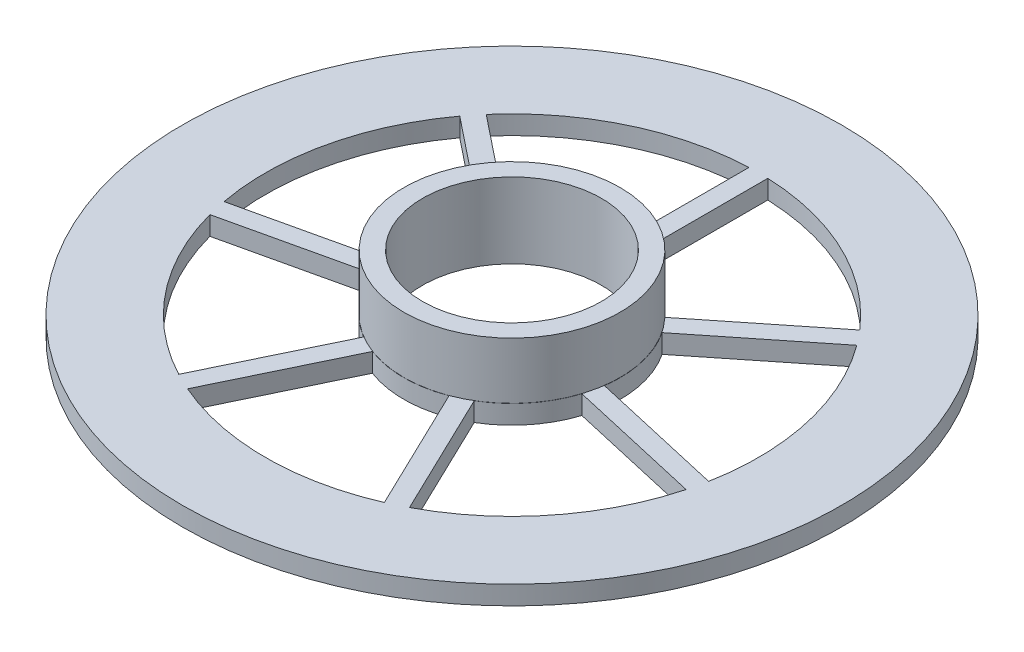
ISO-10303-21;
HEADER;
FILE_DESCRIPTION(('STEP AP214'),'2;1');
FILE_NAME('part.step','',(''),(''),'','','');
FILE_SCHEMA(('AUTOMOTIVE_DESIGN { 1 0 10303 214 1 1 1 1 }'));
ENDSEC;
DATA;
#1=APPLICATION_CONTEXT('core data for automotive mechanical design processes');
#2=APPLICATION_PROTOCOL_DEFINITION('international standard','automotive_design',2000,#1);
#3=PRODUCT_CONTEXT('',#1,'mechanical');
#4=PRODUCT('Part','Part','',(#3));
#5=PRODUCT_RELATED_PRODUCT_CATEGORY('part','',(#4));
#6=PRODUCT_DEFINITION_FORMATION('','',#4);
#7=PRODUCT_DEFINITION_CONTEXT('part definition',#1,'design');
#8=PRODUCT_DEFINITION('design','',#6,#7);
#9=PRODUCT_DEFINITION_SHAPE('','',#8);
#10=(LENGTH_UNIT() NAMED_UNIT(*) SI_UNIT(.MILLI.,.METRE.));
#11=(NAMED_UNIT(*) PLANE_ANGLE_UNIT() SI_UNIT($,.RADIAN.));
#12=(NAMED_UNIT(*) SI_UNIT($,.STERADIAN.) SOLID_ANGLE_UNIT());
#13=UNCERTAINTY_MEASURE_WITH_UNIT(LENGTH_MEASURE(1.E-05),#10,'distance_accuracy_value','');
#14=(GEOMETRIC_REPRESENTATION_CONTEXT(3) GLOBAL_UNCERTAINTY_ASSIGNED_CONTEXT((#13)) GLOBAL_UNIT_ASSIGNED_CONTEXT((#10,
#11,#12)) REPRESENTATION_CONTEXT('',''));
#15=CARTESIAN_POINT('',(0.,0.,0.));
#16=DIRECTION('',(0.,0.,1.));
#17=DIRECTION('',(1.,0.,0.));
#18=AXIS2_PLACEMENT_3D('',#15,#16,#17);
#19=CARTESIAN_POINT('',(0.,18.,0.));
#20=DIRECTION('',(0.,-1.,0.));
#21=DIRECTION('',(0.,0.,-1.));
#22=AXIS2_PLACEMENT_3D('',#19,#20,#21);
#23=CYLINDRICAL_SURFACE('',#22,9.5);
#24=CARTESIAN_POINT('',(0.,0.,0.));
#25=DIRECTION('',(0.,1.,0.));
#26=DIRECTION('',(0.,0.,1.));
#27=AXIS2_PLACEMENT_3D('',#24,#25,#26);
#28=CIRCLE('',#27,9.5);
#29=CARTESIAN_POINT('',(0.,0.,9.5));
#30=VERTEX_POINT('',#29);
#31=EDGE_CURVE('E371',#30,#30,#28,.T.);
#32=ORIENTED_EDGE('',*,*,#31,.F.);
#33=EDGE_LOOP('',(#32));
#34=FACE_BOUND('',#33,.T.);
#35=CARTESIAN_POINT('',(0.,8.,0.));
#36=DIRECTION('',(0.,1.,0.));
#37=DIRECTION('',(0.,0.,1.));
#38=AXIS2_PLACEMENT_3D('',#35,#36,#37);
#39=CIRCLE('',#38,9.5);
#40=CARTESIAN_POINT('',(0.,8.,9.5));
#41=VERTEX_POINT('',#40);
#42=EDGE_CURVE('E474',#41,#41,#39,.T.);
#43=ORIENTED_EDGE('',*,*,#42,.T.);
#44=EDGE_LOOP('',(#43));
#45=FACE_BOUND('',#44,.T.);
#46=ADVANCED_FACE('F35',(#34,#45),#23,.F.);
#47=CARTESIAN_POINT('',(0.,2.,0.));
#48=DIRECTION('',(0.,1.,0.));
#49=DIRECTION('',(0.,0.,1.));
#50=AXIS2_PLACEMENT_3D('',#47,#48,#49);
#51=CYLINDRICAL_SURFACE('',#50,11.4826099486734);
#52=CARTESIAN_POINT('',(0.,2.,0.));
#53=DIRECTION('',(0.,1.,0.));
#54=DIRECTION('',(0.,0.,1.));
#55=AXIS2_PLACEMENT_3D('',#52,#53,#54);
#56=CIRCLE('',#55,11.4826099486734);
#57=CARTESIAN_POINT('',(0.,2.,11.4826099486734));
#58=VERTEX_POINT('',#57);
#59=EDGE_CURVE('E237',#58,#58,#56,.T.);
#60=ORIENTED_EDGE('',*,*,#59,.T.);
#61=EDGE_LOOP('',(#60));
#62=FACE_BOUND('',#61,.T.);
#63=CARTESIAN_POINT('',(0.,8.,0.));
#64=DIRECTION('',(0.,1.,0.));
#65=DIRECTION('',(0.,0.,1.));
#66=AXIS2_PLACEMENT_3D('',#63,#64,#65);
#67=CIRCLE('',#66,11.4826099486734);
#68=CARTESIAN_POINT('',(0.,8.,11.4826099486734));
#69=VERTEX_POINT('',#68);
#70=EDGE_CURVE('E39',#69,#69,#67,.F.);
#71=ORIENTED_EDGE('',*,*,#70,.T.);
#72=EDGE_LOOP('',(#71));
#73=FACE_BOUND('',#72,.T.);
#74=ADVANCED_FACE('F481',(#62,#73),#51,.T.);
#75=CARTESIAN_POINT('',(0.,18.,0.));
#76=DIRECTION('',(0.,-1.,0.));
#77=DIRECTION('',(0.,0.,-1.));
#78=AXIS2_PLACEMENT_3D('',#75,#76,#77);
#79=CYLINDRICAL_SURFACE('',#78,35.);
#80=CARTESIAN_POINT('',(0.,0.,0.));
#81=DIRECTION('',(0.,1.,0.));
#82=DIRECTION('',(0.,0.,1.));
#83=AXIS2_PLACEMENT_3D('',#80,#81,#82);
#84=CIRCLE('',#83,35.);
#85=CARTESIAN_POINT('',(0.,0.,35.));
#86=VERTEX_POINT('',#85);
#87=EDGE_CURVE('E44',#86,#86,#84,.T.);
#88=ORIENTED_EDGE('',*,*,#87,.T.);
#89=EDGE_LOOP('',(#88));
#90=FACE_BOUND('',#89,.T.);
#91=CARTESIAN_POINT('',(0.,2.,0.));
#92=DIRECTION('',(0.,1.,0.));
#93=DIRECTION('',(0.,0.,1.));
#94=AXIS2_PLACEMENT_3D('',#91,#92,#93);
#95=CIRCLE('',#94,35.);
#96=CARTESIAN_POINT('',(0.,2.,35.));
#97=VERTEX_POINT('',#96);
#98=EDGE_CURVE('E396',#97,#97,#95,.T.);
#99=ORIENTED_EDGE('',*,*,#98,.F.);
#100=EDGE_LOOP('',(#99));
#101=FACE_BOUND('',#100,.T.);
#102=ADVANCED_FACE('F37',(#90,#101),#79,.T.);
#103=CARTESIAN_POINT('',(0.,18.,0.));
#104=DIRECTION('',(0.,-1.,0.));
#105=DIRECTION('',(0.,0.,-1.));
#106=AXIS2_PLACEMENT_3D('',#103,#104,#105);
#107=CYLINDRICAL_SURFACE('',#106,26.1837593960554);
#108=DIRECTION('',(0.,-1.,0.));
#109=VECTOR('',#108,1.);
#110=CARTESIAN_POINT('',(-1.,18.,-26.1646566212997));
#111=LINE('',#110,#109);
#112=CARTESIAN_POINT('',(-1.,2.,-26.1646566212997));
#113=VERTEX_POINT('',#112);
#114=CARTESIAN_POINT('',(-1.,0.,-26.1646566212997));
#115=VERTEX_POINT('',#114);
#116=EDGE_CURVE('E363',#113,#115,#111,.T.);
#117=ORIENTED_EDGE('',*,*,#116,.F.);
#118=CARTESIAN_POINT('',(0.,2.,0.));
#119=DIRECTION('',(0.,1.,0.));
#120=DIRECTION('',(0.,0.,1.));
#121=AXIS2_PLACEMENT_3D('',#118,#119,#120);
#122=CIRCLE('',#121,26.1837593960554);
#123=CARTESIAN_POINT('',(-19.8328624726392,2.,-17.0952280549837));
#124=VERTEX_POINT('',#123);
#125=EDGE_CURVE('E51',#113,#124,#122,.T.);
#126=ORIENTED_EDGE('',*,*,#125,.T.);
#127=DIRECTION('',(0.,-1.,0.));
#128=VECTOR('',#127,1.);
#129=CARTESIAN_POINT('',(-19.8328624726392,18.,-17.0952280549837));
#130=LINE('',#129,#128);
#131=CARTESIAN_POINT('',(-19.8328624726392,0.,-17.0952280549837));
#132=VERTEX_POINT('',#131);
#133=EDGE_CURVE('E369',#124,#132,#130,.T.);
#134=ORIENTED_EDGE('',*,*,#133,.T.);
#135=CARTESIAN_POINT('',(0.,0.,0.));
#136=DIRECTION('',(0.,1.,0.));
#137=DIRECTION('',(0.,0.,1.));
#138=AXIS2_PLACEMENT_3D('',#135,#136,#137);
#139=CIRCLE('',#138,26.1837593960554);
#140=EDGE_CURVE('E351',#115,#132,#139,.T.);
#141=ORIENTED_EDGE('',*,*,#140,.F.);
#142=EDGE_LOOP('',(#117,#126,#134,#141));
#143=FACE_BOUND('',#142,.T.);
#144=ADVANCED_FACE('F502',(#143),#107,.F.);
#145=CARTESIAN_POINT('',(-19.8328624726392,18.,-17.0952280549837));
#146=DIRECTION('',(0.623489801858733,0.,-0.78183148246803));
#147=DIRECTION('',(-0.78183148246803,0.,-0.623489801858734));
#148=AXIS2_PLACEMENT_3D('',#145,#146,#147);
#149=PLANE('',#148);
#150=ORIENTED_EDGE('',*,*,#133,.F.);
#151=DIRECTION('',(0.78183148246803,0.,0.623489801858734));
#152=VECTOR('',#151,1.);
#153=CARTESIAN_POINT('',(-19.8328624726392,2.,-17.0952280549837));
#154=LINE('',#153,#152);
#155=CARTESIAN_POINT('',(-8.33351507091476,2.,-7.9248045125944));
#156=VERTEX_POINT('',#155);
#157=EDGE_CURVE('E405',#124,#156,#154,.T.);
#158=ORIENTED_EDGE('',*,*,#157,.T.);
#159=DIRECTION('',(0.,-1.,0.));
#160=VECTOR('',#159,1.);
#161=CARTESIAN_POINT('',(-8.33351507091476,18.,-7.9248045125944));
#162=LINE('',#161,#160);
#163=CARTESIAN_POINT('',(-8.33351507091476,0.,-7.9248045125944));
#164=VERTEX_POINT('',#163);
#165=EDGE_CURVE('E367',#156,#164,#162,.T.);
#166=ORIENTED_EDGE('',*,*,#165,.T.);
#167=DIRECTION('',(0.78183148246803,0.,0.623489801858733));
#168=VECTOR('',#167,1.);
#169=CARTESIAN_POINT('',(-19.8328624726392,0.,-17.0952280549837));
#170=LINE('',#169,#168);
#171=EDGE_CURVE('E354',#132,#164,#170,.T.);
#172=ORIENTED_EDGE('',*,*,#171,.F.);
#173=EDGE_LOOP('',(#150,#158,#166,#172));
#174=FACE_BOUND('',#173,.T.);
#175=ADVANCED_FACE('F505',(#174),#149,.T.);
#176=CARTESIAN_POINT('',(0.,18.,0.));
#177=DIRECTION('',(0.,-1.,0.));
#178=DIRECTION('',(0.,0.,-1.));
#179=AXIS2_PLACEMENT_3D('',#176,#177,#178);
#180=CYLINDRICAL_SURFACE('',#179,11.5);
#181=ORIENTED_EDGE('',*,*,#165,.F.);
#182=CARTESIAN_POINT('',(0.,2.,0.));
#183=DIRECTION('',(0.,1.,0.));
#184=DIRECTION('',(0.,0.,1.));
#185=AXIS2_PLACEMENT_3D('',#182,#183,#184);
#186=CIRCLE('',#185,11.5);
#187=CARTESIAN_POINT('',(-0.999999999999998,2.,-11.4564392373896));
#188=VERTEX_POINT('',#187);
#189=EDGE_CURVE('E408',#156,#188,#186,.F.);
#190=ORIENTED_EDGE('',*,*,#189,.T.);
#191=DIRECTION('',(0.,-1.,0.));
#192=VECTOR('',#191,1.);
#193=CARTESIAN_POINT('',(-0.999999999999998,18.,-11.4564392373896));
#194=LINE('',#193,#192);
#195=CARTESIAN_POINT('',(-0.999999999999998,0.,-11.4564392373896));
#196=VERTEX_POINT('',#195);
#197=EDGE_CURVE('E365',#188,#196,#194,.T.);
#198=ORIENTED_EDGE('',*,*,#197,.T.);
#199=CARTESIAN_POINT('',(0.,0.,0.));
#200=DIRECTION('',(0.,-1.,0.));
#201=DIRECTION('',(0.,0.,1.));
#202=AXIS2_PLACEMENT_3D('',#199,#200,#201);
#203=CIRCLE('',#202,11.5);
#204=EDGE_CURVE('E357',#164,#196,#203,.T.);
#205=ORIENTED_EDGE('',*,*,#204,.F.);
#206=EDGE_LOOP('',(#181,#190,#198,#205));
#207=FACE_BOUND('',#206,.T.);
#208=ADVANCED_FACE('F509',(#207),#180,.T.);
#209=CARTESIAN_POINT('',(-1.,18.,-26.1646566212997));
#210=DIRECTION('',(-1.,0.,0.));
#211=DIRECTION('',(0.,0.,1.));
#212=AXIS2_PLACEMENT_3D('',#209,#210,#211);
#213=PLANE('',#212);
#214=ORIENTED_EDGE('',*,*,#197,.F.);
#215=DIRECTION('',(0.,0.,-1.));
#216=VECTOR('',#215,1.);
#217=CARTESIAN_POINT('',(-1.,2.,-26.1646566212997));
#218=LINE('',#217,#216);
#219=EDGE_CURVE('E411',#188,#113,#218,.T.);
#220=ORIENTED_EDGE('',*,*,#219,.T.);
#221=ORIENTED_EDGE('',*,*,#116,.T.);
#222=DIRECTION('',(0.,0.,-1.));
#223=VECTOR('',#222,1.);
#224=CARTESIAN_POINT('',(-1.,0.,-26.1646566212997));
#225=LINE('',#224,#223);
#226=EDGE_CURVE('E360',#196,#115,#225,.T.);
#227=ORIENTED_EDGE('',*,*,#226,.F.);
#228=EDGE_LOOP('',(#214,#220,#221,#227));
#229=FACE_BOUND('',#228,.T.);
#230=ADVANCED_FACE('F513',(#229),#213,.T.);
#231=CARTESIAN_POINT('',(0.,18.,0.));
#232=DIRECTION('',(0.,-1.,0.));
#233=DIRECTION('',(0.,0.,-1.));
#234=AXIS2_PLACEMENT_3D('',#231,#232,#233);
#235=CYLINDRICAL_SURFACE('',#234,26.1837593960554);
#236=DIRECTION('',(0.,-1.,0.));
#237=VECTOR('',#236,1.);
#238=CARTESIAN_POINT('',(25.7311749867147,18.,4.84725591583431));
#239=LINE('',#238,#237);
#240=CARTESIAN_POINT('',(25.7311749867147,2.,4.84725591583431));
#241=VERTEX_POINT('',#240);
#242=CARTESIAN_POINT('',(25.7311749867147,0.,4.84725591583431));
#243=VERTEX_POINT('',#242);
#244=EDGE_CURVE('E343',#241,#243,#239,.T.);
#245=ORIENTED_EDGE('',*,*,#244,.F.);
#246=CARTESIAN_POINT('',(0.,2.,0.));
#247=DIRECTION('',(0.,1.,0.));
#248=DIRECTION('',(0.,0.,1.));
#249=AXIS2_PLACEMENT_3D('',#246,#247,#248);
#250=CIRCLE('',#249,26.1837593960554);
#251=CARTESIAN_POINT('',(21.079842076356,2.,-15.5315650900484));
#252=VERTEX_POINT('',#251);
#253=EDGE_CURVE('E59',#241,#252,#250,.T.);
#254=ORIENTED_EDGE('',*,*,#253,.T.);
#255=DIRECTION('',(0.,-1.,0.));
#256=VECTOR('',#255,1.);
#257=CARTESIAN_POINT('',(21.079842076356,18.,-15.5315650900484));
#258=LINE('',#257,#256);
#259=CARTESIAN_POINT('',(21.079842076356,0.,-15.5315650900484));
#260=VERTEX_POINT('',#259);
#261=EDGE_CURVE('E349',#252,#260,#258,.T.);
#262=ORIENTED_EDGE('',*,*,#261,.T.);
#263=CARTESIAN_POINT('',(0.,0.,0.));
#264=DIRECTION('',(0.,1.,0.));
#265=DIRECTION('',(0.,0.,1.));
#266=AXIS2_PLACEMENT_3D('',#263,#264,#265);
#267=CIRCLE('',#266,26.1837593960554);
#268=EDGE_CURVE('E331',#243,#260,#267,.T.);
#269=ORIENTED_EDGE('',*,*,#268,.F.);
#270=EDGE_LOOP('',(#245,#254,#262,#269));
#271=FACE_BOUND('',#270,.T.);
#272=ADVANCED_FACE('F517',(#271),#235,.F.);
#273=CARTESIAN_POINT('',(21.079842076356,18.,-15.5315650900484));
#274=DIRECTION('',(0.623489801858734,0.,0.78183148246803));
#275=DIRECTION('',(0.78183148246803,0.,-0.623489801858734));
#276=AXIS2_PLACEMENT_3D('',#273,#274,#275);
#277=PLANE('',#276);
#278=ORIENTED_EDGE('',*,*,#261,.F.);
#279=DIRECTION('',(-0.78183148246803,0.,0.623489801858734));
#280=VECTOR('',#279,1.);
#281=CARTESIAN_POINT('',(21.079842076356,2.,-15.5315650900484));
#282=LINE('',#281,#280);
#283=CARTESIAN_POINT('',(9.58049467463161,2.,-6.36114154765913));
#284=VERTEX_POINT('',#283);
#285=EDGE_CURVE('E414',#252,#284,#282,.T.);
#286=ORIENTED_EDGE('',*,*,#285,.T.);
#287=DIRECTION('',(0.,-1.,0.));
#288=VECTOR('',#287,1.);
#289=CARTESIAN_POINT('',(9.58049467463162,18.,-6.36114154765914));
#290=LINE('',#289,#288);
#291=CARTESIAN_POINT('',(9.58049467463162,0.,-6.36114154765914));
#292=VERTEX_POINT('',#291);
#293=EDGE_CURVE('E347',#284,#292,#290,.T.);
#294=ORIENTED_EDGE('',*,*,#293,.T.);
#295=DIRECTION('',(-0.78183148246803,0.,0.623489801858734));
#296=VECTOR('',#295,1.);
#297=CARTESIAN_POINT('',(21.079842076356,0.,-15.5315650900484));
#298=LINE('',#297,#296);
#299=EDGE_CURVE('E334',#260,#292,#298,.T.);
#300=ORIENTED_EDGE('',*,*,#299,.F.);
#301=EDGE_LOOP('',(#278,#286,#294,#300));
#302=FACE_BOUND('',#301,.T.);
#303=ADVANCED_FACE('F521',(#302),#277,.T.);
#304=CARTESIAN_POINT('',(0.,18.,0.));
#305=DIRECTION('',(0.,-1.,0.));
#306=DIRECTION('',(0.,0.,-1.));
#307=AXIS2_PLACEMENT_3D('',#304,#305,#306);
#308=CYLINDRICAL_SURFACE('',#307,11.5);
#309=ORIENTED_EDGE('',*,*,#293,.F.);
#310=CARTESIAN_POINT('',(0.,2.,0.));
#311=DIRECTION('',(0.,1.,0.));
#312=DIRECTION('',(0.,0.,1.));
#313=AXIS2_PLACEMENT_3D('',#310,#311,#312);
#314=CIRCLE('',#313,11.5);
#315=CARTESIAN_POINT('',(11.3917233207027,2.,1.57436964673412));
#316=VERTEX_POINT('',#315);
#317=EDGE_CURVE('E417',#284,#316,#314,.F.);
#318=ORIENTED_EDGE('',*,*,#317,.T.);
#319=DIRECTION('',(0.,-1.,0.));
#320=VECTOR('',#319,1.);
#321=CARTESIAN_POINT('',(11.3917233207027,18.,1.57436964673412));
#322=LINE('',#321,#320);
#323=CARTESIAN_POINT('',(11.3917233207027,0.,1.57436964673412));
#324=VERTEX_POINT('',#323);
#325=EDGE_CURVE('E345',#316,#324,#322,.T.);
#326=ORIENTED_EDGE('',*,*,#325,.T.);
#327=CARTESIAN_POINT('',(0.,0.,0.));
#328=DIRECTION('',(0.,-1.,0.));
#329=DIRECTION('',(0.,0.,1.));
#330=AXIS2_PLACEMENT_3D('',#327,#328,#329);
#331=CIRCLE('',#330,11.5);
#332=EDGE_CURVE('E337',#292,#324,#331,.T.);
#333=ORIENTED_EDGE('',*,*,#332,.F.);
#334=EDGE_LOOP('',(#309,#318,#326,#333));
#335=FACE_BOUND('',#334,.T.);
#336=ADVANCED_FACE('F525',(#335),#308,.T.);
#337=CARTESIAN_POINT('',(25.7311749867147,18.,4.84725591583431));
#338=DIRECTION('',(0.222520933956314,0.,-0.974927912181824));
#339=DIRECTION('',(-0.974927912181824,0.,-0.222520933956314));
#340=AXIS2_PLACEMENT_3D('',#337,#338,#339);
#341=PLANE('',#340);
#342=ORIENTED_EDGE('',*,*,#325,.F.);
#343=DIRECTION('',(0.974927912181824,0.,0.222520933956314));
#344=VECTOR('',#343,1.);
#345=CARTESIAN_POINT('',(25.7311749867147,2.,4.84725591583431));
#346=LINE('',#345,#344);
#347=EDGE_CURVE('E420',#316,#241,#346,.T.);
#348=ORIENTED_EDGE('',*,*,#347,.T.);
#349=ORIENTED_EDGE('',*,*,#244,.T.);
#350=DIRECTION('',(0.974927912181824,0.,0.222520933956314));
#351=VECTOR('',#350,1.);
#352=CARTESIAN_POINT('',(25.7311749867147,0.,4.84725591583431));
#353=LINE('',#352,#351);
#354=EDGE_CURVE('E340',#324,#243,#353,.T.);
#355=ORIENTED_EDGE('',*,*,#354,.F.);
#356=EDGE_LOOP('',(#342,#348,#349,#355));
#357=FACE_BOUND('',#356,.T.);
#358=ADVANCED_FACE('F529',(#357),#341,.T.);
#359=CARTESIAN_POINT('',(0.,18.,0.));
#360=DIRECTION('',(0.,-1.,0.));
#361=DIRECTION('',(0.,0.,-1.));
#362=AXIS2_PLACEMENT_3D('',#359,#360,#361);
#363=CYLINDRICAL_SURFACE('',#362,11.5);
#364=DIRECTION('',(0.,-1.,0.));
#365=VECTOR('',#364,1.);
#366=CARTESIAN_POINT('',(0.999999999999998,18.,-11.4564392373896));
#367=LINE('',#366,#365);
#368=CARTESIAN_POINT('',(0.999999999999998,2.,-11.4564392373896));
#369=VERTEX_POINT('',#368);
#370=CARTESIAN_POINT('',(0.999999999999998,0.,-11.4564392373896));
#371=VERTEX_POINT('',#370);
#372=EDGE_CURVE('E323',#369,#371,#367,.T.);
#373=ORIENTED_EDGE('',*,*,#372,.F.);
#374=CARTESIAN_POINT('',(0.,2.,0.));
#375=DIRECTION('',(0.,1.,0.));
#376=DIRECTION('',(0.,0.,1.));
#377=AXIS2_PLACEMENT_3D('',#374,#375,#376);
#378=CIRCLE('',#377,11.5);
#379=CARTESIAN_POINT('',(8.33351507091407,2.,-7.92480451259513));
#380=VERTEX_POINT('',#379);
#381=EDGE_CURVE('E422',#369,#380,#378,.F.);
#382=ORIENTED_EDGE('',*,*,#381,.T.);
#383=DIRECTION('',(0.,-1.,0.));
#384=VECTOR('',#383,1.);
#385=CARTESIAN_POINT('',(8.33351507091407,18.,-7.92480451259513));
#386=LINE('',#385,#384);
#387=CARTESIAN_POINT('',(8.33351507091407,0.,-7.92480451259513));
#388=VERTEX_POINT('',#387);
#389=EDGE_CURVE('E329',#380,#388,#386,.T.);
#390=ORIENTED_EDGE('',*,*,#389,.T.);
#391=CARTESIAN_POINT('',(0.,0.,0.));
#392=DIRECTION('',(0.,-1.,0.));
#393=DIRECTION('',(0.,0.,1.));
#394=AXIS2_PLACEMENT_3D('',#391,#392,#393);
#395=CIRCLE('',#394,11.5);
#396=EDGE_CURVE('E311',#371,#388,#395,.T.);
#397=ORIENTED_EDGE('',*,*,#396,.F.);
#398=EDGE_LOOP('',(#373,#382,#390,#397));
#399=FACE_BOUND('',#398,.T.);
#400=ADVANCED_FACE('F533',(#399),#363,.T.);
#401=CARTESIAN_POINT('',(19.8328624726385,18.,-17.0952280549844));
#402=DIRECTION('',(-0.623489801858734,0.,-0.78183148246803));
#403=DIRECTION('',(-0.78183148246803,0.,0.623489801858734));
#404=AXIS2_PLACEMENT_3D('',#401,#402,#403);
#405=PLANE('',#404);
#406=ORIENTED_EDGE('',*,*,#389,.F.);
#407=DIRECTION('',(0.78183148246803,0.,-0.623489801858734));
#408=VECTOR('',#407,1.);
#409=CARTESIAN_POINT('',(19.8328624726385,2.,-17.0952280549844));
#410=LINE('',#409,#408);
#411=CARTESIAN_POINT('',(19.8328624726385,2.,-17.0952280549844));
#412=VERTEX_POINT('',#411);
#413=EDGE_CURVE('E425',#380,#412,#410,.T.);
#414=ORIENTED_EDGE('',*,*,#413,.T.);
#415=DIRECTION('',(0.,-1.,0.));
#416=VECTOR('',#415,1.);
#417=CARTESIAN_POINT('',(19.8328624726385,18.,-17.0952280549844));
#418=LINE('',#417,#416);
#419=CARTESIAN_POINT('',(19.8328624726385,0.,-17.0952280549844));
#420=VERTEX_POINT('',#419);
#421=EDGE_CURVE('E327',#412,#420,#418,.T.);
#422=ORIENTED_EDGE('',*,*,#421,.T.);
#423=DIRECTION('',(0.78183148246803,0.,-0.623489801858734));
#424=VECTOR('',#423,1.);
#425=CARTESIAN_POINT('',(19.8328624726385,0.,-17.0952280549844));
#426=LINE('',#425,#424);
#427=EDGE_CURVE('E314',#388,#420,#426,.T.);
#428=ORIENTED_EDGE('',*,*,#427,.F.);
#429=EDGE_LOOP('',(#406,#414,#422,#428));
#430=FACE_BOUND('',#429,.T.);
#431=ADVANCED_FACE('F537',(#430),#405,.T.);
#432=CARTESIAN_POINT('',(0.,18.,0.));
#433=DIRECTION('',(0.,-1.,0.));
#434=DIRECTION('',(0.,0.,-1.));
#435=AXIS2_PLACEMENT_3D('',#432,#433,#434);
#436=CYLINDRICAL_SURFACE('',#435,26.1837593960554);
#437=ORIENTED_EDGE('',*,*,#421,.F.);
#438=CARTESIAN_POINT('',(0.,2.,0.));
#439=DIRECTION('',(0.,1.,0.));
#440=DIRECTION('',(0.,0.,1.));
#441=AXIS2_PLACEMENT_3D('',#438,#439,#440);
#442=CIRCLE('',#441,26.1837593960554);
#443=CARTESIAN_POINT('',(1.,2.,-26.1646566212997));
#444=VERTEX_POINT('',#443);
#445=EDGE_CURVE('E428',#412,#444,#442,.T.);
#446=ORIENTED_EDGE('',*,*,#445,.T.);
#447=DIRECTION('',(0.,-1.,0.));
#448=VECTOR('',#447,1.);
#449=CARTESIAN_POINT('',(1.00000000000001,18.,-26.1646566212997));
#450=LINE('',#449,#448);
#451=CARTESIAN_POINT('',(1.00000000000001,0.,-26.1646566212997));
#452=VERTEX_POINT('',#451);
#453=EDGE_CURVE('E325',#444,#452,#450,.T.);
#454=ORIENTED_EDGE('',*,*,#453,.T.);
#455=CARTESIAN_POINT('',(0.,0.,0.));
#456=DIRECTION('',(0.,1.,0.));
#457=DIRECTION('',(0.,0.,1.));
#458=AXIS2_PLACEMENT_3D('',#455,#456,#457);
#459=CIRCLE('',#458,26.1837593960554);
#460=EDGE_CURVE('E317',#420,#452,#459,.T.);
#461=ORIENTED_EDGE('',*,*,#460,.F.);
#462=EDGE_LOOP('',(#437,#446,#454,#461));
#463=FACE_BOUND('',#462,.T.);
#464=ADVANCED_FACE('F541',(#463),#436,.F.);
#465=CARTESIAN_POINT('',(1.,18.,-26.1646566212997));
#466=DIRECTION('',(1.,0.,0.));
#467=DIRECTION('',(0.,0.,-1.));
#468=AXIS2_PLACEMENT_3D('',#465,#466,#467);
#469=PLANE('',#468);
#470=ORIENTED_EDGE('',*,*,#453,.F.);
#471=DIRECTION('',(0.,0.,1.));
#472=VECTOR('',#471,1.);
#473=CARTESIAN_POINT('',(1.,2.,-26.1646566212997));
#474=LINE('',#473,#472);
#475=EDGE_CURVE('E431',#444,#369,#474,.T.);
#476=ORIENTED_EDGE('',*,*,#475,.T.);
#477=ORIENTED_EDGE('',*,*,#372,.T.);
#478=DIRECTION('',(0.,0.,1.));
#479=VECTOR('',#478,1.);
#480=CARTESIAN_POINT('',(1.,0.,-26.1646566212997));
#481=LINE('',#480,#479);
#482=EDGE_CURVE('E320',#452,#371,#481,.T.);
#483=ORIENTED_EDGE('',*,*,#482,.F.);
#484=EDGE_LOOP('',(#470,#476,#477,#483));
#485=FACE_BOUND('',#484,.T.);
#486=ADVANCED_FACE('F545',(#485),#469,.T.);
#487=CARTESIAN_POINT('',(0.,18.,0.));
#488=DIRECTION('',(0.,-1.,0.));
#489=DIRECTION('',(0.,0.,-1.));
#490=AXIS2_PLACEMENT_3D('',#487,#488,#489);
#491=CYLINDRICAL_SURFACE('',#490,26.1837593960554);
#492=DIRECTION('',(0.,-1.,0.));
#493=VECTOR('',#492,1.);
#494=CARTESIAN_POINT('',(-21.0798420763567,18.,-15.5315650900476));
#495=LINE('',#494,#493);
#496=CARTESIAN_POINT('',(-21.0798420763567,2.,-15.5315650900476));
#497=VERTEX_POINT('',#496);
#498=CARTESIAN_POINT('',(-21.0798420763567,0.,-15.5315650900476));
#499=VERTEX_POINT('',#498);
#500=EDGE_CURVE('E303',#497,#499,#495,.T.);
#501=ORIENTED_EDGE('',*,*,#500,.F.);
#502=CARTESIAN_POINT('',(0.,2.,0.));
#503=DIRECTION('',(0.,1.,0.));
#504=DIRECTION('',(0.,0.,1.));
#505=AXIS2_PLACEMENT_3D('',#502,#503,#504);
#506=CIRCLE('',#505,26.1837593960554);
#507=CARTESIAN_POINT('',(-25.731174986714,2.,4.84725591583754));
#508=VERTEX_POINT('',#507);
#509=EDGE_CURVE('E434',#497,#508,#506,.T.);
#510=ORIENTED_EDGE('',*,*,#509,.T.);
#511=DIRECTION('',(0.,-1.,0.));
#512=VECTOR('',#511,1.);
#513=CARTESIAN_POINT('',(-25.731174986714,18.,4.84725591583754));
#514=LINE('',#513,#512);
#515=CARTESIAN_POINT('',(-25.731174986714,0.,4.84725591583754));
#516=VERTEX_POINT('',#515);
#517=EDGE_CURVE('E309',#508,#516,#514,.T.);
#518=ORIENTED_EDGE('',*,*,#517,.T.);
#519=CARTESIAN_POINT('',(0.,0.,0.));
#520=DIRECTION('',(0.,1.,0.));
#521=DIRECTION('',(0.,0.,1.));
#522=AXIS2_PLACEMENT_3D('',#519,#520,#521);
#523=CIRCLE('',#522,26.1837593960554);
#524=EDGE_CURVE('E291',#499,#516,#523,.T.);
#525=ORIENTED_EDGE('',*,*,#524,.F.);
#526=EDGE_LOOP('',(#501,#510,#518,#525));
#527=FACE_BOUND('',#526,.T.);
#528=ADVANCED_FACE('F549',(#527),#491,.F.);
#529=CARTESIAN_POINT('',(-25.731174986714,18.,4.84725591583754));
#530=DIRECTION('',(-0.222520933956315,0.,-0.974927912181823));
#531=DIRECTION('',(-0.974927912181824,0.,0.222520933956315));
#532=AXIS2_PLACEMENT_3D('',#529,#530,#531);
#533=PLANE('',#532);
#534=ORIENTED_EDGE('',*,*,#517,.F.);
#535=DIRECTION('',(0.974927912181824,0.,-0.222520933956315));
#536=VECTOR('',#535,1.);
#537=CARTESIAN_POINT('',(-25.731174986714,2.,4.84725591583754));
#538=LINE('',#537,#536);
#539=CARTESIAN_POINT('',(-11.3917233207023,2.,1.57436964673739));
#540=VERTEX_POINT('',#539);
#541=EDGE_CURVE('E437',#508,#540,#538,.T.);
#542=ORIENTED_EDGE('',*,*,#541,.T.);
#543=DIRECTION('',(0.,-1.,0.));
#544=VECTOR('',#543,1.);
#545=CARTESIAN_POINT('',(-11.3917233207023,18.,1.57436964673739));
#546=LINE('',#545,#544);
#547=CARTESIAN_POINT('',(-11.3917233207023,0.,1.57436964673739));
#548=VERTEX_POINT('',#547);
#549=EDGE_CURVE('E307',#540,#548,#546,.T.);
#550=ORIENTED_EDGE('',*,*,#549,.T.);
#551=DIRECTION('',(0.974927912181824,0.,-0.222520933956315));
#552=VECTOR('',#551,1.);
#553=CARTESIAN_POINT('',(-25.731174986714,0.,4.84725591583754));
#554=LINE('',#553,#552);
#555=EDGE_CURVE('E294',#516,#548,#554,.T.);
#556=ORIENTED_EDGE('',*,*,#555,.F.);
#557=EDGE_LOOP('',(#534,#542,#550,#556));
#558=FACE_BOUND('',#557,.T.);
#559=ADVANCED_FACE('F553',(#558),#533,.T.);
#560=CARTESIAN_POINT('',(0.,18.,0.));
#561=DIRECTION('',(0.,-1.,0.));
#562=DIRECTION('',(0.,0.,-1.));
#563=AXIS2_PLACEMENT_3D('',#560,#561,#562);
#564=CYLINDRICAL_SURFACE('',#563,11.5);
#565=ORIENTED_EDGE('',*,*,#549,.F.);
#566=CARTESIAN_POINT('',(0.,2.,0.));
#567=DIRECTION('',(0.,1.,0.));
#568=DIRECTION('',(0.,0.,1.));
#569=AXIS2_PLACEMENT_3D('',#566,#567,#568);
#570=CIRCLE('',#569,11.5);
#571=CARTESIAN_POINT('',(-9.58049467463218,2.,-6.36114154765829));
#572=VERTEX_POINT('',#571);
#573=EDGE_CURVE('E440',#540,#572,#570,.F.);
#574=ORIENTED_EDGE('',*,*,#573,.T.);
#575=DIRECTION('',(0.,-1.,0.));
#576=VECTOR('',#575,1.);
#577=CARTESIAN_POINT('',(-9.58049467463218,18.,-6.36114154765829));
#578=LINE('',#577,#576);
#579=CARTESIAN_POINT('',(-9.58049467463218,0.,-6.36114154765829));
#580=VERTEX_POINT('',#579);
#581=EDGE_CURVE('E305',#572,#580,#578,.T.);
#582=ORIENTED_EDGE('',*,*,#581,.T.);
#583=CARTESIAN_POINT('',(0.,0.,0.));
#584=DIRECTION('',(0.,-1.,0.));
#585=DIRECTION('',(0.,0.,1.));
#586=AXIS2_PLACEMENT_3D('',#583,#584,#585);
#587=CIRCLE('',#586,11.5);
#588=EDGE_CURVE('E297',#548,#580,#587,.T.);
#589=ORIENTED_EDGE('',*,*,#588,.F.);
#590=EDGE_LOOP('',(#565,#574,#582,#589));
#591=FACE_BOUND('',#590,.T.);
#592=ADVANCED_FACE('F557',(#591),#564,.T.);
#593=CARTESIAN_POINT('',(-21.0798420763567,18.,-15.5315650900476));
#594=DIRECTION('',(-0.623489801858733,0.,0.78183148246803));
#595=DIRECTION('',(0.78183148246803,0.,0.623489801858733));
#596=AXIS2_PLACEMENT_3D('',#593,#594,#595);
#597=PLANE('',#596);
#598=ORIENTED_EDGE('',*,*,#581,.F.);
#599=DIRECTION('',(-0.78183148246803,0.,-0.623489801858733));
#600=VECTOR('',#599,1.);
#601=CARTESIAN_POINT('',(-21.0798420763567,2.,-15.5315650900476));
#602=LINE('',#601,#600);
#603=EDGE_CURVE('E443',#572,#497,#602,.T.);
#604=ORIENTED_EDGE('',*,*,#603,.T.);
#605=ORIENTED_EDGE('',*,*,#500,.T.);
#606=DIRECTION('',(-0.78183148246803,0.,-0.623489801858733));
#607=VECTOR('',#606,1.);
#608=CARTESIAN_POINT('',(-21.0798420763567,0.,-15.5315650900476));
#609=LINE('',#608,#607);
#610=EDGE_CURVE('E300',#580,#499,#609,.T.);
#611=ORIENTED_EDGE('',*,*,#610,.F.);
#612=EDGE_LOOP('',(#598,#604,#605,#611));
#613=FACE_BOUND('',#612,.T.);
#614=ADVANCED_FACE('F561',(#613),#597,.T.);
#615=CARTESIAN_POINT('',(0.,18.,0.));
#616=DIRECTION('',(0.,-1.,0.));
#617=DIRECTION('',(0.,0.,-1.));
#618=AXIS2_PLACEMENT_3D('',#615,#616,#617);
#619=CYLINDRICAL_SURFACE('',#618,26.1837593960554);
#620=DIRECTION('',(0.,-1.,0.));
#621=VECTOR('',#620,1.);
#622=CARTESIAN_POINT('',(12.2533879154812,18.,23.1396573160291));
#623=LINE('',#622,#621);
#624=CARTESIAN_POINT('',(12.2533879154812,2.,23.1396573160291));
#625=VERTEX_POINT('',#624);
#626=CARTESIAN_POINT('',(12.2533879154812,0.,23.1396573160291));
#627=VERTEX_POINT('',#626);
#628=EDGE_CURVE('E283',#625,#627,#623,.T.);
#629=ORIENTED_EDGE('',*,*,#628,.F.);
#630=CARTESIAN_POINT('',(0.,2.,0.));
#631=DIRECTION('',(0.,1.,0.));
#632=DIRECTION('',(0.,0.,1.));
#633=AXIS2_PLACEMENT_3D('',#630,#631,#632);
#634=CIRCLE('',#633,26.1837593960554);
#635=CARTESIAN_POINT('',(25.2861331188022,2.,6.79711174019798));
#636=VERTEX_POINT('',#635);
#637=EDGE_CURVE('E446',#625,#636,#634,.T.);
#638=ORIENTED_EDGE('',*,*,#637,.T.);
#639=DIRECTION('',(0.,-1.,0.));
#640=VECTOR('',#639,1.);
#641=CARTESIAN_POINT('',(25.2861331188022,18.,6.79711174019798));
#642=LINE('',#641,#640);
#643=CARTESIAN_POINT('',(25.2861331188022,0.,6.79711174019798));
#644=VERTEX_POINT('',#643);
#645=EDGE_CURVE('E289',#636,#644,#642,.T.);
#646=ORIENTED_EDGE('',*,*,#645,.T.);
#647=CARTESIAN_POINT('',(0.,0.,0.));
#648=DIRECTION('',(0.,1.,0.));
#649=DIRECTION('',(0.,0.,1.));
#650=AXIS2_PLACEMENT_3D('',#647,#648,#649);
#651=CIRCLE('',#650,26.1837593960554);
#652=EDGE_CURVE('E271',#627,#644,#651,.T.);
#653=ORIENTED_EDGE('',*,*,#652,.F.);
#654=EDGE_LOOP('',(#629,#638,#646,#653));
#655=FACE_BOUND('',#654,.T.);
#656=ADVANCED_FACE('F565',(#655),#619,.F.);
#657=CARTESIAN_POINT('',(25.2861331188022,18.,6.79711174019798));
#658=DIRECTION('',(-0.222520933956314,0.,0.974927912181824));
#659=DIRECTION('',(0.974927912181824,0.,0.222520933956314));
#660=AXIS2_PLACEMENT_3D('',#657,#658,#659);
#661=PLANE('',#660);
#662=ORIENTED_EDGE('',*,*,#645,.F.);
#663=DIRECTION('',(-0.974927912181824,0.,-0.222520933956314));
#664=VECTOR('',#663,1.);
#665=CARTESIAN_POINT('',(25.2861331188022,2.,6.79711174019798));
#666=LINE('',#665,#664);
#667=CARTESIAN_POINT('',(10.9466814527904,2.,3.52422547109784));
#668=VERTEX_POINT('',#667);
#669=EDGE_CURVE('E449',#636,#668,#666,.T.);
#670=ORIENTED_EDGE('',*,*,#669,.T.);
#671=DIRECTION('',(0.,-1.,0.));
#672=VECTOR('',#671,1.);
#673=CARTESIAN_POINT('',(10.9466814527904,18.,3.52422547109784));
#674=LINE('',#673,#672);
#675=CARTESIAN_POINT('',(10.9466814527904,0.,3.52422547109784));
#676=VERTEX_POINT('',#675);
#677=EDGE_CURVE('E287',#668,#676,#674,.T.);
#678=ORIENTED_EDGE('',*,*,#677,.T.);
#679=DIRECTION('',(-0.974927912181824,0.,-0.222520933956314));
#680=VECTOR('',#679,1.);
#681=CARTESIAN_POINT('',(25.2861331188022,0.,6.79711174019798));
#682=LINE('',#681,#680);
#683=EDGE_CURVE('E274',#644,#676,#682,.T.);
#684=ORIENTED_EDGE('',*,*,#683,.F.);
#685=EDGE_LOOP('',(#662,#670,#678,#684));
#686=FACE_BOUND('',#685,.T.);
#687=ADVANCED_FACE('F569',(#686),#661,.T.);
#688=CARTESIAN_POINT('',(0.,18.,0.));
#689=DIRECTION('',(0.,-1.,0.));
#690=DIRECTION('',(0.,0.,-1.));
#691=AXIS2_PLACEMENT_3D('',#688,#689,#690);
#692=CYLINDRICAL_SURFACE('',#691,11.5);
#693=ORIENTED_EDGE('',*,*,#677,.F.);
#694=CARTESIAN_POINT('',(0.,2.,0.));
#695=DIRECTION('',(0.,1.,0.));
#696=DIRECTION('',(0.,0.,1.));
#697=AXIS2_PLACEMENT_3D('',#694,#695,#696);
#698=CIRCLE('',#697,11.5);
#699=CARTESIAN_POINT('',(5.87173156119637,2.,9.88801135078487));
#700=VERTEX_POINT('',#699);
#701=EDGE_CURVE('E452',#668,#700,#698,.F.);
#702=ORIENTED_EDGE('',*,*,#701,.T.);
#703=DIRECTION('',(0.,-1.,0.));
#704=VECTOR('',#703,1.);
#705=CARTESIAN_POINT('',(5.87173156119638,18.,9.88801135078487));
#706=LINE('',#705,#704);
#707=CARTESIAN_POINT('',(5.87173156119638,0.,9.88801135078487));
#708=VERTEX_POINT('',#707);
#709=EDGE_CURVE('E285',#700,#708,#706,.T.);
#710=ORIENTED_EDGE('',*,*,#709,.T.);
#711=CARTESIAN_POINT('',(0.,0.,0.));
#712=DIRECTION('',(0.,-1.,0.));
#713=DIRECTION('',(0.,0.,1.));
#714=AXIS2_PLACEMENT_3D('',#711,#712,#713);
#715=CIRCLE('',#714,11.5);
#716=EDGE_CURVE('E277',#676,#708,#715,.T.);
#717=ORIENTED_EDGE('',*,*,#716,.F.);
#718=EDGE_LOOP('',(#693,#702,#710,#717));
#719=FACE_BOUND('',#718,.T.);
#720=ADVANCED_FACE('F573',(#719),#692,.T.);
#721=CARTESIAN_POINT('',(12.2533879154812,18.,23.1396573160291));
#722=DIRECTION('',(0.900968867902419,0.,-0.433883739117558));
#723=DIRECTION('',(-0.433883739117559,0.,-0.900968867902419));
#724=AXIS2_PLACEMENT_3D('',#721,#722,#723);
#725=PLANE('',#724);
#726=ORIENTED_EDGE('',*,*,#709,.F.);
#727=DIRECTION('',(0.433883739117559,0.,0.900968867902419));
#728=VECTOR('',#727,1.);
#729=CARTESIAN_POINT('',(12.2533879154812,2.,23.1396573160291));
#730=LINE('',#729,#728);
#731=EDGE_CURVE('E455',#700,#625,#730,.T.);
#732=ORIENTED_EDGE('',*,*,#731,.T.);
#733=ORIENTED_EDGE('',*,*,#628,.T.);
#734=DIRECTION('',(0.433883739117559,0.,0.900968867902419));
#735=VECTOR('',#734,1.);
#736=CARTESIAN_POINT('',(12.2533879154812,0.,23.1396573160291));
#737=LINE('',#736,#735);
#738=EDGE_CURVE('E280',#708,#627,#737,.T.);
#739=ORIENTED_EDGE('',*,*,#738,.F.);
#740=EDGE_LOOP('',(#726,#732,#733,#739));
#741=FACE_BOUND('',#740,.T.);
#742=ADVANCED_FACE('F577',(#741),#725,.T.);
#743=CARTESIAN_POINT('',(0.,18.,0.));
#744=DIRECTION('',(0.,-1.,0.));
#745=DIRECTION('',(0.,0.,-1.));
#746=AXIS2_PLACEMENT_3D('',#743,#744,#745);
#747=CYLINDRICAL_SURFACE('',#746,26.1837593960554);
#748=DIRECTION('',(0.,-1.,0.));
#749=VECTOR('',#748,1.);
#750=CARTESIAN_POINT('',(-10.4514501796718,18.,24.0074247942665));
#751=LINE('',#750,#749);
#752=CARTESIAN_POINT('',(-10.4514501796718,2.,24.0074247942665));
#753=VERTEX_POINT('',#752);
#754=CARTESIAN_POINT('',(-10.4514501796718,0.,24.0074247942665));
#755=VERTEX_POINT('',#754);
#756=EDGE_CURVE('E263',#753,#755,#751,.T.);
#757=ORIENTED_EDGE('',*,*,#756,.F.);
#758=CARTESIAN_POINT('',(0.,2.,0.));
#759=DIRECTION('',(0.,1.,0.));
#760=DIRECTION('',(0.,0.,1.));
#761=AXIS2_PLACEMENT_3D('',#758,#759,#760);
#762=CIRCLE('',#761,26.1837593960554);
#763=CARTESIAN_POINT('',(10.4514501796765,2.,24.0074247942644));
#764=VERTEX_POINT('',#763);
#765=EDGE_CURVE('E458',#753,#764,#762,.T.);
#766=ORIENTED_EDGE('',*,*,#765,.T.);
#767=DIRECTION('',(0.,-1.,0.));
#768=VECTOR('',#767,1.);
#769=CARTESIAN_POINT('',(10.4514501796765,18.,24.0074247942644));
#770=LINE('',#769,#768);
#771=CARTESIAN_POINT('',(10.4514501796765,0.,24.0074247942644));
#772=VERTEX_POINT('',#771);
#773=EDGE_CURVE('E269',#764,#772,#770,.T.);
#774=ORIENTED_EDGE('',*,*,#773,.T.);
#775=CARTESIAN_POINT('',(0.,0.,0.));
#776=DIRECTION('',(0.,1.,0.));
#777=DIRECTION('',(0.,0.,1.));
#778=AXIS2_PLACEMENT_3D('',#775,#776,#777);
#779=CIRCLE('',#778,26.1837593960554);
#780=EDGE_CURVE('E251',#755,#772,#779,.T.);
#781=ORIENTED_EDGE('',*,*,#780,.F.);
#782=EDGE_LOOP('',(#757,#766,#774,#781));
#783=FACE_BOUND('',#782,.T.);
#784=ADVANCED_FACE('F581',(#783),#747,.F.);
#785=CARTESIAN_POINT('',(10.4514501796765,18.,24.0074247942644));
#786=DIRECTION('',(-0.900968867902419,0.,0.433883739117558));
#787=DIRECTION('',(0.433883739117558,0.,0.900968867902419));
#788=AXIS2_PLACEMENT_3D('',#785,#786,#787);
#789=PLANE('',#788);
#790=ORIENTED_EDGE('',*,*,#773,.F.);
#791=DIRECTION('',(-0.433883739117558,0.,-0.900968867902419));
#792=VECTOR('',#791,1.);
#793=CARTESIAN_POINT('',(10.4514501796765,2.,24.0074247942644));
#794=LINE('',#793,#792);
#795=CARTESIAN_POINT('',(4.06979382539173,2.,10.7557788290204));
#796=VERTEX_POINT('',#795);
#797=EDGE_CURVE('E461',#764,#796,#794,.T.);
#798=ORIENTED_EDGE('',*,*,#797,.T.);
#799=DIRECTION('',(0.,-1.,0.));
#800=VECTOR('',#799,1.);
#801=CARTESIAN_POINT('',(4.06979382539173,18.,10.7557788290204));
#802=LINE('',#801,#800);
#803=CARTESIAN_POINT('',(4.06979382539173,0.,10.7557788290204));
#804=VERTEX_POINT('',#803);
#805=EDGE_CURVE('E267',#796,#804,#802,.T.);
#806=ORIENTED_EDGE('',*,*,#805,.T.);
#807=DIRECTION('',(-0.433883739117558,0.,-0.900968867902419));
#808=VECTOR('',#807,1.);
#809=CARTESIAN_POINT('',(10.4514501796765,0.,24.0074247942644));
#810=LINE('',#809,#808);
#811=EDGE_CURVE('E254',#772,#804,#810,.T.);
#812=ORIENTED_EDGE('',*,*,#811,.F.);
#813=EDGE_LOOP('',(#790,#798,#806,#812));
#814=FACE_BOUND('',#813,.T.);
#815=ADVANCED_FACE('F585',(#814),#789,.T.);
#816=CARTESIAN_POINT('',(0.,18.,0.));
#817=DIRECTION('',(0.,-1.,0.));
#818=DIRECTION('',(0.,0.,-1.));
#819=AXIS2_PLACEMENT_3D('',#816,#817,#818);
#820=CYLINDRICAL_SURFACE('',#819,11.5);
#821=ORIENTED_EDGE('',*,*,#805,.F.);
#822=CARTESIAN_POINT('',(0.,2.,0.));
#823=DIRECTION('',(0.,1.,0.));
#824=DIRECTION('',(0.,0.,1.));
#825=AXIS2_PLACEMENT_3D('',#822,#823,#824);
#826=CIRCLE('',#825,11.5);
#827=CARTESIAN_POINT('',(-4.06979382538694,2.,10.7557788290222));
#828=VERTEX_POINT('',#827);
#829=EDGE_CURVE('E464',#796,#828,#826,.F.);
#830=ORIENTED_EDGE('',*,*,#829,.T.);
#831=DIRECTION('',(0.,-1.,0.));
#832=VECTOR('',#831,1.);
#833=CARTESIAN_POINT('',(-4.06979382538695,18.,10.7557788290222));
#834=LINE('',#833,#832);
#835=CARTESIAN_POINT('',(-4.06979382538695,0.,10.7557788290222));
#836=VERTEX_POINT('',#835);
#837=EDGE_CURVE('E265',#828,#836,#834,.T.);
#838=ORIENTED_EDGE('',*,*,#837,.T.);
#839=CARTESIAN_POINT('',(0.,0.,0.));
#840=DIRECTION('',(0.,-1.,0.));
#841=DIRECTION('',(0.,0.,1.));
#842=AXIS2_PLACEMENT_3D('',#839,#840,#841);
#843=CIRCLE('',#842,11.5);
#844=EDGE_CURVE('E257',#804,#836,#843,.T.);
#845=ORIENTED_EDGE('',*,*,#844,.F.);
#846=EDGE_LOOP('',(#821,#830,#838,#845));
#847=FACE_BOUND('',#846,.T.);
#848=ADVANCED_FACE('F589',(#847),#820,.T.);
#849=CARTESIAN_POINT('',(-10.4514501796718,18.,24.0074247942665));
#850=DIRECTION('',(0.900968867902419,0.,0.433883739117558));
#851=DIRECTION('',(0.433883739117558,0.,-0.900968867902419));
#852=AXIS2_PLACEMENT_3D('',#849,#850,#851);
#853=PLANE('',#852);
#854=ORIENTED_EDGE('',*,*,#837,.F.);
#855=DIRECTION('',(-0.433883739117558,0.,0.900968867902419));
#856=VECTOR('',#855,1.);
#857=CARTESIAN_POINT('',(-10.4514501796718,2.,24.0074247942665));
#858=LINE('',#857,#856);
#859=EDGE_CURVE('E467',#828,#753,#858,.T.);
#860=ORIENTED_EDGE('',*,*,#859,.T.);
#861=ORIENTED_EDGE('',*,*,#756,.T.);
#862=DIRECTION('',(-0.433883739117558,0.,0.900968867902419));
#863=VECTOR('',#862,1.);
#864=CARTESIAN_POINT('',(-10.4514501796718,0.,24.0074247942665));
#865=LINE('',#864,#863);
#866=EDGE_CURVE('E260',#836,#755,#865,.T.);
#867=ORIENTED_EDGE('',*,*,#866,.F.);
#868=EDGE_LOOP('',(#854,#860,#861,#867));
#869=FACE_BOUND('',#868,.T.);
#870=ADVANCED_FACE('F593',(#869),#853,.T.);
#871=CARTESIAN_POINT('',(0.,18.,0.));
#872=DIRECTION('',(0.,-1.,0.));
#873=DIRECTION('',(0.,0.,-1.));
#874=AXIS2_PLACEMENT_3D('',#871,#872,#873);
#875=CYLINDRICAL_SURFACE('',#874,26.1837593960554);
#876=DIRECTION('',(0.,-1.,0.));
#877=VECTOR('',#876,1.);
#878=CARTESIAN_POINT('',(-25.2861331188013,18.,6.79711174020116));
#879=LINE('',#878,#877);
#880=CARTESIAN_POINT('',(-25.2861331188013,2.,6.79711174020116));
#881=VERTEX_POINT('',#880);
#882=CARTESIAN_POINT('',(-25.2861331188013,0.,6.79711174020116));
#883=VERTEX_POINT('',#882);
#884=EDGE_CURVE('E243',#881,#883,#879,.T.);
#885=ORIENTED_EDGE('',*,*,#884,.F.);
#886=CARTESIAN_POINT('',(0.,2.,0.));
#887=DIRECTION('',(0.,1.,0.));
#888=DIRECTION('',(0.,0.,1.));
#889=AXIS2_PLACEMENT_3D('',#886,#887,#888);
#890=CIRCLE('',#889,26.1837593960554);
#891=CARTESIAN_POINT('',(-12.2533879154767,2.,23.1396573160315));
#892=VERTEX_POINT('',#891);
#893=EDGE_CURVE('E225',#881,#892,#890,.T.);
#894=ORIENTED_EDGE('',*,*,#893,.T.);
#895=DIRECTION('',(0.,-1.,0.));
#896=VECTOR('',#895,1.);
#897=CARTESIAN_POINT('',(-12.2533879154767,18.,23.1396573160315));
#898=LINE('',#897,#896);
#899=CARTESIAN_POINT('',(-12.2533879154767,0.,23.1396573160315));
#900=VERTEX_POINT('',#899);
#901=EDGE_CURVE('E245',#892,#900,#898,.T.);
#902=ORIENTED_EDGE('',*,*,#901,.T.);
#903=CARTESIAN_POINT('',(0.,0.,0.));
#904=DIRECTION('',(0.,1.,0.));
#905=DIRECTION('',(0.,0.,1.));
#906=AXIS2_PLACEMENT_3D('',#903,#904,#905);
#907=CIRCLE('',#906,26.1837593960554);
#908=EDGE_CURVE('E392',#883,#900,#907,.T.);
#909=ORIENTED_EDGE('',*,*,#908,.F.);
#910=EDGE_LOOP('',(#885,#894,#902,#909));
#911=FACE_BOUND('',#910,.T.);
#912=ADVANCED_FACE('F597',(#911),#875,.F.);
#913=CARTESIAN_POINT('',(-12.2533879154767,18.,23.1396573160315));
#914=DIRECTION('',(-0.900968867902419,0.,-0.433883739117558));
#915=DIRECTION('',(-0.433883739117558,0.,0.900968867902419));
#916=AXIS2_PLACEMENT_3D('',#913,#914,#915);
#917=PLANE('',#916);
#918=ORIENTED_EDGE('',*,*,#901,.F.);
#919=DIRECTION('',(0.433883739117558,0.,-0.900968867902419));
#920=VECTOR('',#919,1.);
#921=CARTESIAN_POINT('',(-12.2533879154767,2.,23.1396573160315));
#922=LINE('',#921,#920);
#923=CARTESIAN_POINT('',(-5.87173156119197,2.,9.88801135078748));
#924=VERTEX_POINT('',#923);
#925=EDGE_CURVE('E236',#892,#924,#922,.T.);
#926=ORIENTED_EDGE('',*,*,#925,.T.);
#927=DIRECTION('',(0.,-1.,0.));
#928=VECTOR('',#927,1.);
#929=CARTESIAN_POINT('',(-5.87173156119197,18.,9.88801135078748));
#930=LINE('',#929,#928);
#931=CARTESIAN_POINT('',(-5.87173156119197,0.,9.88801135078748));
#932=VERTEX_POINT('',#931);
#933=EDGE_CURVE('E235',#924,#932,#930,.T.);
#934=ORIENTED_EDGE('',*,*,#933,.T.);
#935=DIRECTION('',(0.433883739117558,0.,-0.900968867902419));
#936=VECTOR('',#935,1.);
#937=CARTESIAN_POINT('',(-12.2533879154767,0.,23.1396573160315));
#938=LINE('',#937,#936);
#939=EDGE_CURVE('E394',#900,#932,#938,.T.);
#940=ORIENTED_EDGE('',*,*,#939,.F.);
#941=EDGE_LOOP('',(#918,#926,#934,#940));
#942=FACE_BOUND('',#941,.T.);
#943=ADVANCED_FACE('F601',(#942),#917,.T.);
#944=CARTESIAN_POINT('',(0.,18.,0.));
#945=DIRECTION('',(0.,-1.,0.));
#946=DIRECTION('',(0.,0.,-1.));
#947=AXIS2_PLACEMENT_3D('',#944,#945,#946);
#948=CYLINDRICAL_SURFACE('',#947,11.5);
#949=ORIENTED_EDGE('',*,*,#933,.F.);
#950=CARTESIAN_POINT('',(0.,2.,0.));
#951=DIRECTION('',(0.,1.,0.));
#952=DIRECTION('',(0.,0.,1.));
#953=AXIS2_PLACEMENT_3D('',#950,#951,#952);
#954=CIRCLE('',#953,11.5);
#955=CARTESIAN_POINT('',(-10.9466814527894,2.,3.52422547110097));
#956=VERTEX_POINT('',#955);
#957=EDGE_CURVE('E222',#924,#956,#954,.F.);
#958=ORIENTED_EDGE('',*,*,#957,.T.);
#959=DIRECTION('',(0.,-1.,0.));
#960=VECTOR('',#959,1.);
#961=CARTESIAN_POINT('',(-10.9466814527894,18.,3.52422547110097));
#962=LINE('',#961,#960);
#963=CARTESIAN_POINT('',(-10.9466814527894,0.,3.52422547110097));
#964=VERTEX_POINT('',#963);
#965=EDGE_CURVE('E233',#956,#964,#962,.T.);
#966=ORIENTED_EDGE('',*,*,#965,.T.);
#967=CARTESIAN_POINT('',(0.,0.,0.));
#968=DIRECTION('',(0.,-1.,0.));
#969=DIRECTION('',(0.,0.,1.));
#970=AXIS2_PLACEMENT_3D('',#967,#968,#969);
#971=CIRCLE('',#970,11.5);
#972=EDGE_CURVE('E398',#932,#964,#971,.T.);
#973=ORIENTED_EDGE('',*,*,#972,.F.);
#974=EDGE_LOOP('',(#949,#958,#966,#973));
#975=FACE_BOUND('',#974,.T.);
#976=ADVANCED_FACE('F231',(#975),#948,.T.);
#977=CARTESIAN_POINT('',(-25.2861331188013,18.,6.79711174020116));
#978=DIRECTION('',(0.222520933956315,0.,0.974927912181823));
#979=DIRECTION('',(0.974927912181824,0.,-0.222520933956315));
#980=AXIS2_PLACEMENT_3D('',#977,#978,#979);
#981=PLANE('',#980);
#982=ORIENTED_EDGE('',*,*,#965,.F.);
#983=DIRECTION('',(-0.974927912181824,0.,0.222520933956315));
#984=VECTOR('',#983,1.);
#985=CARTESIAN_POINT('',(-25.2861331188013,2.,6.79711174020116));
#986=LINE('',#985,#984);
#987=EDGE_CURVE('E11',#956,#881,#986,.T.);
#988=ORIENTED_EDGE('',*,*,#987,.T.);
#989=ORIENTED_EDGE('',*,*,#884,.T.);
#990=DIRECTION('',(-0.974927912181824,0.,0.222520933956315));
#991=VECTOR('',#990,1.);
#992=CARTESIAN_POINT('',(-25.2861331188013,0.,6.79711174020116));
#993=LINE('',#992,#991);
#994=EDGE_CURVE('E241',#964,#883,#993,.T.);
#995=ORIENTED_EDGE('',*,*,#994,.F.);
#996=EDGE_LOOP('',(#982,#988,#989,#995));
#997=FACE_BOUND('',#996,.T.);
#998=ADVANCED_FACE('F239',(#997),#981,.T.);
#999=CARTESIAN_POINT('',(0.,0.,0.));
#1000=DIRECTION('',(0.,1.,0.));
#1001=DIRECTION('',(0.,0.,1.));
#1002=AXIS2_PLACEMENT_3D('',#999,#1000,#1001);
#1003=PLANE('',#1002);
#1004=ORIENTED_EDGE('',*,*,#780,.T.);
#1005=ORIENTED_EDGE('',*,*,#811,.T.);
#1006=ORIENTED_EDGE('',*,*,#844,.T.);
#1007=ORIENTED_EDGE('',*,*,#866,.T.);
#1008=EDGE_LOOP('',(#1004,#1005,#1006,#1007));
#1009=FACE_BOUND('',#1008,.T.);
#1010=ORIENTED_EDGE('',*,*,#524,.T.);
#1011=ORIENTED_EDGE('',*,*,#555,.T.);
#1012=ORIENTED_EDGE('',*,*,#588,.T.);
#1013=ORIENTED_EDGE('',*,*,#610,.T.);
#1014=EDGE_LOOP('',(#1010,#1011,#1012,#1013));
#1015=FACE_BOUND('',#1014,.T.);
#1016=ORIENTED_EDGE('',*,*,#268,.T.);
#1017=ORIENTED_EDGE('',*,*,#299,.T.);
#1018=ORIENTED_EDGE('',*,*,#332,.T.);
#1019=ORIENTED_EDGE('',*,*,#354,.T.);
#1020=EDGE_LOOP('',(#1016,#1017,#1018,#1019));
#1021=FACE_BOUND('',#1020,.T.);
#1022=ORIENTED_EDGE('',*,*,#31,.T.);
#1023=EDGE_LOOP('',(#1022));
#1024=FACE_BOUND('',#1023,.T.);
#1025=ORIENTED_EDGE('',*,*,#87,.F.);
#1026=EDGE_LOOP('',(#1025));
#1027=FACE_BOUND('',#1026,.T.);
#1028=ORIENTED_EDGE('',*,*,#140,.T.);
#1029=ORIENTED_EDGE('',*,*,#171,.T.);
#1030=ORIENTED_EDGE('',*,*,#204,.T.);
#1031=ORIENTED_EDGE('',*,*,#226,.T.);
#1032=EDGE_LOOP('',(#1028,#1029,#1030,#1031));
#1033=FACE_BOUND('',#1032,.T.);
#1034=ORIENTED_EDGE('',*,*,#396,.T.);
#1035=ORIENTED_EDGE('',*,*,#427,.T.);
#1036=ORIENTED_EDGE('',*,*,#460,.T.);
#1037=ORIENTED_EDGE('',*,*,#482,.T.);
#1038=EDGE_LOOP('',(#1034,#1035,#1036,#1037));
#1039=FACE_BOUND('',#1038,.T.);
#1040=ORIENTED_EDGE('',*,*,#652,.T.);
#1041=ORIENTED_EDGE('',*,*,#683,.T.);
#1042=ORIENTED_EDGE('',*,*,#716,.T.);
#1043=ORIENTED_EDGE('',*,*,#738,.T.);
#1044=EDGE_LOOP('',(#1040,#1041,#1042,#1043));
#1045=FACE_BOUND('',#1044,.T.);
#1046=ORIENTED_EDGE('',*,*,#908,.T.);
#1047=ORIENTED_EDGE('',*,*,#939,.T.);
#1048=ORIENTED_EDGE('',*,*,#972,.T.);
#1049=ORIENTED_EDGE('',*,*,#994,.T.);
#1050=EDGE_LOOP('',(#1046,#1047,#1048,#1049));
#1051=FACE_BOUND('',#1050,.T.);
#1052=ADVANCED_FACE('F379',(#1009,#1015,#1021,#1024,#1027,#1033,#1039,#1045,#1051),#1003,.F.);
#1053=CARTESIAN_POINT('',(0.,2.,0.));
#1054=DIRECTION('',(0.,1.,0.));
#1055=DIRECTION('',(0.,0.,1.));
#1056=AXIS2_PLACEMENT_3D('',#1053,#1054,#1055);
#1057=PLANE('',#1056);
#1058=ORIENTED_EDGE('',*,*,#59,.F.);
#1059=EDGE_LOOP('',(#1058));
#1060=FACE_BOUND('',#1059,.T.);
#1061=ORIENTED_EDGE('',*,*,#987,.F.);
#1062=ORIENTED_EDGE('',*,*,#957,.F.);
#1063=ORIENTED_EDGE('',*,*,#925,.F.);
#1064=ORIENTED_EDGE('',*,*,#893,.F.);
#1065=EDGE_LOOP('',(#1061,#1062,#1063,#1064));
#1066=FACE_BOUND('',#1065,.T.);
#1067=ORIENTED_EDGE('',*,*,#859,.F.);
#1068=ORIENTED_EDGE('',*,*,#829,.F.);
#1069=ORIENTED_EDGE('',*,*,#797,.F.);
#1070=ORIENTED_EDGE('',*,*,#765,.F.);
#1071=EDGE_LOOP('',(#1067,#1068,#1069,#1070));
#1072=FACE_BOUND('',#1071,.T.);
#1073=ORIENTED_EDGE('',*,*,#731,.F.);
#1074=ORIENTED_EDGE('',*,*,#701,.F.);
#1075=ORIENTED_EDGE('',*,*,#669,.F.);
#1076=ORIENTED_EDGE('',*,*,#637,.F.);
#1077=EDGE_LOOP('',(#1073,#1074,#1075,#1076));
#1078=FACE_BOUND('',#1077,.T.);
#1079=ORIENTED_EDGE('',*,*,#603,.F.);
#1080=ORIENTED_EDGE('',*,*,#573,.F.);
#1081=ORIENTED_EDGE('',*,*,#541,.F.);
#1082=ORIENTED_EDGE('',*,*,#509,.F.);
#1083=EDGE_LOOP('',(#1079,#1080,#1081,#1082));
#1084=FACE_BOUND('',#1083,.T.);
#1085=ORIENTED_EDGE('',*,*,#475,.F.);
#1086=ORIENTED_EDGE('',*,*,#445,.F.);
#1087=ORIENTED_EDGE('',*,*,#413,.F.);
#1088=ORIENTED_EDGE('',*,*,#381,.F.);
#1089=EDGE_LOOP('',(#1085,#1086,#1087,#1088));
#1090=FACE_BOUND('',#1089,.T.);
#1091=ORIENTED_EDGE('',*,*,#347,.F.);
#1092=ORIENTED_EDGE('',*,*,#317,.F.);
#1093=ORIENTED_EDGE('',*,*,#285,.F.);
#1094=ORIENTED_EDGE('',*,*,#253,.F.);
#1095=EDGE_LOOP('',(#1091,#1092,#1093,#1094));
#1096=FACE_BOUND('',#1095,.T.);
#1097=ORIENTED_EDGE('',*,*,#219,.F.);
#1098=ORIENTED_EDGE('',*,*,#189,.F.);
#1099=ORIENTED_EDGE('',*,*,#157,.F.);
#1100=ORIENTED_EDGE('',*,*,#125,.F.);
#1101=EDGE_LOOP('',(#1097,#1098,#1099,#1100));
#1102=FACE_BOUND('',#1101,.T.);
#1103=ORIENTED_EDGE('',*,*,#98,.T.);
#1104=EDGE_LOOP('',(#1103));
#1105=FACE_BOUND('',#1104,.T.);
#1106=ADVANCED_FACE('F220',(#1060,#1066,#1072,#1078,#1084,#1090,#1096,#1102,#1105),#1057,.T.);
#1107=CARTESIAN_POINT('',(0.,8.,0.));
#1108=DIRECTION('',(0.,1.,0.));
#1109=DIRECTION('',(0.,0.,1.));
#1110=AXIS2_PLACEMENT_3D('',#1107,#1108,#1109);
#1111=PLANE('',#1110);
#1112=ORIENTED_EDGE('',*,*,#42,.F.);
#1113=EDGE_LOOP('',(#1112));
#1114=FACE_BOUND('',#1113,.T.);
#1115=ORIENTED_EDGE('',*,*,#70,.F.);
#1116=EDGE_LOOP('',(#1115));
#1117=FACE_BOUND('',#1116,.T.);
#1118=ADVANCED_FACE('F483',(#1114,#1117),#1111,.T.);
#1119=CLOSED_SHELL('',(#46,#74,#102,#144,#175,#208,#230,#272,#303,#336,#358,#400,#431,#464,#486,
#528,#559,#592,#614,#656,#687,#720,#742,#784,#815,#848,#870,#912,#943,#976,#998,#1052,#1106,#1118));
#1120=MANIFOLD_SOLID_BREP('B2',#1119);
#1121=ADVANCED_BREP_SHAPE_REPRESENTATION('',(#18,#1120),#14);
#1122=SHAPE_DEFINITION_REPRESENTATION(#9,#1121);
ENDSEC;
END-ISO-10303-21;
